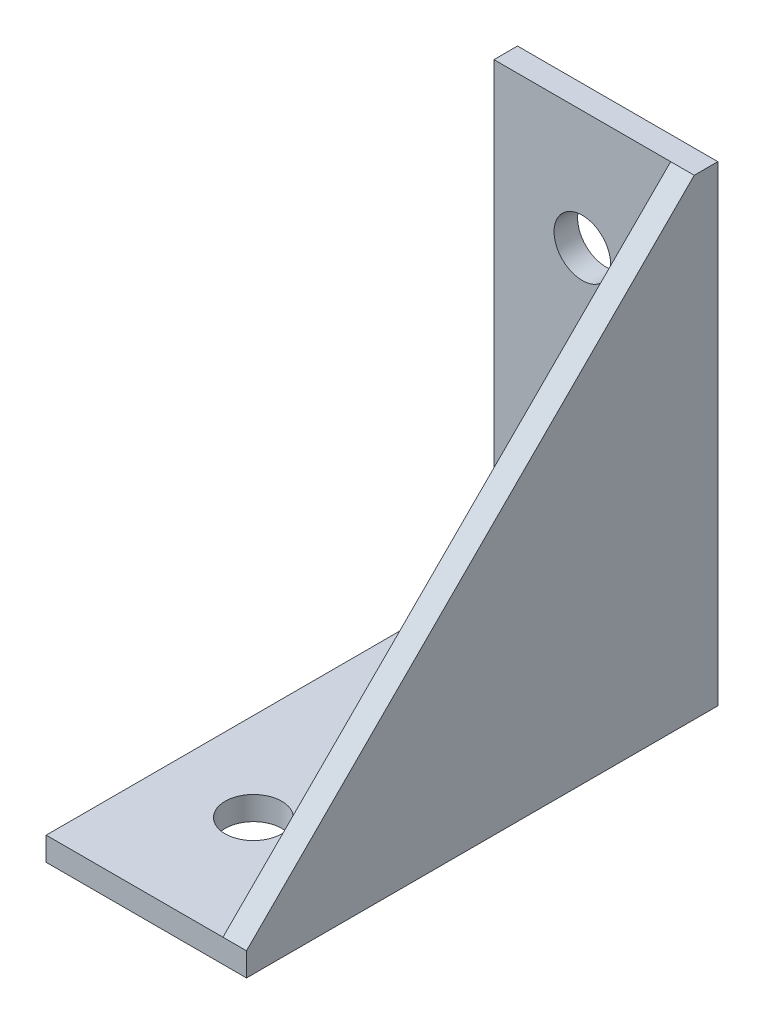
ISO-10303-21;
HEADER;
FILE_DESCRIPTION(('STEP AP214'),'2;1');
FILE_NAME('part.step','',(''),(''),'','','');
FILE_SCHEMA(('AUTOMOTIVE_DESIGN { 1 0 10303 214 1 1 1 1 }'));
ENDSEC;
DATA;
#1=APPLICATION_CONTEXT('core data for automotive mechanical design processes');
#2=APPLICATION_PROTOCOL_DEFINITION('international standard','automotive_design',2000,#1);
#3=PRODUCT_CONTEXT('',#1,'mechanical');
#4=PRODUCT('Part','Part','',(#3));
#5=PRODUCT_RELATED_PRODUCT_CATEGORY('part','',(#4));
#6=PRODUCT_DEFINITION_FORMATION('','',#4);
#7=PRODUCT_DEFINITION_CONTEXT('part definition',#1,'design');
#8=PRODUCT_DEFINITION('design','',#6,#7);
#9=PRODUCT_DEFINITION_SHAPE('','',#8);
#10=(LENGTH_UNIT() NAMED_UNIT(*) SI_UNIT(.MILLI.,.METRE.));
#11=(NAMED_UNIT(*) PLANE_ANGLE_UNIT() SI_UNIT($,.RADIAN.));
#12=(NAMED_UNIT(*) SI_UNIT($,.STERADIAN.) SOLID_ANGLE_UNIT());
#13=UNCERTAINTY_MEASURE_WITH_UNIT(LENGTH_MEASURE(1.E-05),#10,'distance_accuracy_value','');
#14=(GEOMETRIC_REPRESENTATION_CONTEXT(3) GLOBAL_UNCERTAINTY_ASSIGNED_CONTEXT((#13)) GLOBAL_UNIT_ASSIGNED_CONTEXT((#10,
#11,#12)) REPRESENTATION_CONTEXT('',''));
#15=CARTESIAN_POINT('',(0.,0.,0.));
#16=DIRECTION('',(0.,0.,1.));
#17=DIRECTION('',(1.,0.,0.));
#18=AXIS2_PLACEMENT_3D('',#15,#16,#17);
#19=CARTESIAN_POINT('',(-15.,-2.,38.));
#20=DIRECTION('',(0.,-1.,0.));
#21=DIRECTION('',(0.,0.,-1.));
#22=AXIS2_PLACEMENT_3D('',#19,#20,#21);
#23=PLANE('',#22);
#24=CARTESIAN_POINT('',(-7.5,-2.,27.9109691372457));
#25=DIRECTION('',(0.,1.,0.));
#26=DIRECTION('',(0.,0.,1.));
#27=AXIS2_PLACEMENT_3D('',#24,#25,#26);
#28=CIRCLE('',#27,2.4);
#29=CARTESIAN_POINT('',(-7.5,-2.,30.3109691372457));
#30=VERTEX_POINT('',#29);
#31=EDGE_CURVE('E232',#30,#30,#28,.T.);
#32=ORIENTED_EDGE('',*,*,#31,.T.);
#33=EDGE_LOOP('',(#32));
#34=FACE_BOUND('',#33,.T.);
#35=DIRECTION('',(0.,0.,-1.));
#36=VECTOR('',#35,1.);
#37=CARTESIAN_POINT('',(2.,-2.,38.));
#38=LINE('',#37,#36);
#39=CARTESIAN_POINT('',(2.,-2.,38.));
#40=VERTEX_POINT('',#39);
#41=CARTESIAN_POINT('',(2.,-2.,-2.));
#42=VERTEX_POINT('',#41);
#43=EDGE_CURVE('E168',#40,#42,#38,.T.);
#44=ORIENTED_EDGE('',*,*,#43,.F.);
#45=DIRECTION('',(1.,0.,0.));
#46=VECTOR('',#45,1.);
#47=CARTESIAN_POINT('',(-15.,-2.,38.));
#48=LINE('',#47,#46);
#49=CARTESIAN_POINT('',(-15.,-2.,38.));
#50=VERTEX_POINT('',#49);
#51=EDGE_CURVE('E184',#50,#40,#48,.T.);
#52=ORIENTED_EDGE('',*,*,#51,.F.);
#53=DIRECTION('',(0.,0.,-1.));
#54=VECTOR('',#53,1.);
#55=CARTESIAN_POINT('',(-15.,-2.,38.));
#56=LINE('',#55,#54);
#57=CARTESIAN_POINT('',(-15.,-2.,-2.));
#58=VERTEX_POINT('',#57);
#59=EDGE_CURVE('E155',#50,#58,#56,.T.);
#60=ORIENTED_EDGE('',*,*,#59,.T.);
#61=DIRECTION('',(1.,0.,0.));
#62=VECTOR('',#61,1.);
#63=CARTESIAN_POINT('',(-15.,-2.,-2.));
#64=LINE('',#63,#62);
#65=EDGE_CURVE('E181',#58,#42,#64,.T.);
#66=ORIENTED_EDGE('',*,*,#65,.T.);
#67=EDGE_LOOP('',(#44,#52,#60,#66));
#68=FACE_BOUND('',#67,.T.);
#69=CARTESIAN_POINT('',(-7.5,-2.,10.0890308627543));
#70=DIRECTION('',(0.,1.,0.));
#71=DIRECTION('',(0.,0.,1.));
#72=AXIS2_PLACEMENT_3D('',#69,#70,#71);
#73=CIRCLE('',#72,2.4);
#74=CARTESIAN_POINT('',(-7.5,-2.,12.4890308627543));
#75=VERTEX_POINT('',#74);
#76=EDGE_CURVE('E242',#75,#75,#73,.T.);
#77=ORIENTED_EDGE('',*,*,#76,.T.);
#78=EDGE_LOOP('',(#77));
#79=FACE_BOUND('',#78,.T.);
#80=ADVANCED_FACE('F42',(#34,#68,#79),#23,.T.);
#81=CARTESIAN_POINT('',(-15.,-2.,-2.));
#82=DIRECTION('',(0.,0.,-1.));
#83=DIRECTION('',(0.,1.,0.));
#84=AXIS2_PLACEMENT_3D('',#81,#82,#83);
#85=PLANE('',#84);
#86=DIRECTION('',(0.,1.,0.));
#87=VECTOR('',#86,1.);
#88=CARTESIAN_POINT('',(2.,-2.,-2.));
#89=LINE('',#88,#87);
#90=CARTESIAN_POINT('',(2.,38.,-2.));
#91=VERTEX_POINT('',#90);
#92=EDGE_CURVE('E147',#42,#91,#89,.T.);
#93=ORIENTED_EDGE('',*,*,#92,.F.);
#94=ORIENTED_EDGE('',*,*,#65,.F.);
#95=DIRECTION('',(0.,1.,0.));
#96=VECTOR('',#95,1.);
#97=CARTESIAN_POINT('',(-15.,-2.,-2.));
#98=LINE('',#97,#96);
#99=CARTESIAN_POINT('',(-15.,38.,-2.));
#100=VERTEX_POINT('',#99);
#101=EDGE_CURVE('E159',#58,#100,#98,.T.);
#102=ORIENTED_EDGE('',*,*,#101,.T.);
#103=DIRECTION('',(1.,0.,0.));
#104=VECTOR('',#103,1.);
#105=CARTESIAN_POINT('',(-15.,38.,-2.));
#106=LINE('',#105,#104);
#107=EDGE_CURVE('E178',#100,#91,#106,.T.);
#108=ORIENTED_EDGE('',*,*,#107,.T.);
#109=EDGE_LOOP('',(#93,#94,#102,#108));
#110=FACE_BOUND('',#109,.T.);
#111=CARTESIAN_POINT('',(-7.5,10.0890308627543,-2.));
#112=DIRECTION('',(0.,0.,1.));
#113=DIRECTION('',(1.,0.,0.));
#114=AXIS2_PLACEMENT_3D('',#111,#112,#113);
#115=CIRCLE('',#114,2.4);
#116=CARTESIAN_POINT('',(-5.1,10.0890308627543,-2.));
#117=VERTEX_POINT('',#116);
#118=EDGE_CURVE('E150',#117,#117,#115,.T.);
#119=ORIENTED_EDGE('',*,*,#118,.T.);
#120=EDGE_LOOP('',(#119));
#121=FACE_BOUND('',#120,.T.);
#122=CARTESIAN_POINT('',(-7.5,27.9109691372457,-2.));
#123=DIRECTION('',(0.,0.,1.));
#124=DIRECTION('',(1.,0.,0.));
#125=AXIS2_PLACEMENT_3D('',#122,#123,#124);
#126=CIRCLE('',#125,2.4);
#127=CARTESIAN_POINT('',(-5.1,27.9109691372457,-2.));
#128=VERTEX_POINT('',#127);
#129=EDGE_CURVE('E222',#128,#128,#126,.T.);
#130=ORIENTED_EDGE('',*,*,#129,.T.);
#131=EDGE_LOOP('',(#130));
#132=FACE_BOUND('',#131,.T.);
#133=ADVANCED_FACE('F213',(#110,#121,#132),#85,.T.);
#134=CARTESIAN_POINT('',(2.,38.,0.));
#135=DIRECTION('',(0.,-0.707106781186547,-0.707106781186547));
#136=DIRECTION('',(0.,0.707106781186548,-0.707106781186548));
#137=AXIS2_PLACEMENT_3D('',#134,#135,#136);
#138=PLANE('',#137);
#139=DIRECTION('',(0.,-0.707106781186548,0.707106781186548));
#140=VECTOR('',#139,1.);
#141=CARTESIAN_POINT('',(0.,38.,0.));
#142=LINE('',#141,#140);
#143=CARTESIAN_POINT('',(0.,38.,0.));
#144=VERTEX_POINT('',#143);
#145=CARTESIAN_POINT('',(0.,0.,38.));
#146=VERTEX_POINT('',#145);
#147=EDGE_CURVE('E177',#144,#146,#142,.T.);
#148=ORIENTED_EDGE('',*,*,#147,.T.);
#149=DIRECTION('',(-1.,0.,0.));
#150=VECTOR('',#149,1.);
#151=CARTESIAN_POINT('',(2.,0.,38.));
#152=LINE('',#151,#150);
#153=CARTESIAN_POINT('',(2.,0.,38.));
#154=VERTEX_POINT('',#153);
#155=EDGE_CURVE('E11',#154,#146,#152,.T.);
#156=ORIENTED_EDGE('',*,*,#155,.F.);
#157=DIRECTION('',(0.,-0.707106781186548,0.707106781186548));
#158=VECTOR('',#157,1.);
#159=CARTESIAN_POINT('',(2.,38.,0.));
#160=LINE('',#159,#158);
#161=CARTESIAN_POINT('',(2.,38.,0.));
#162=VERTEX_POINT('',#161);
#163=EDGE_CURVE('E62',#162,#154,#160,.T.);
#164=ORIENTED_EDGE('',*,*,#163,.F.);
#165=DIRECTION('',(-1.,0.,0.));
#166=VECTOR('',#165,1.);
#167=CARTESIAN_POINT('',(2.,38.,0.));
#168=LINE('',#167,#166);
#169=EDGE_CURVE('E51',#162,#144,#168,.T.);
#170=ORIENTED_EDGE('',*,*,#169,.T.);
#171=EDGE_LOOP('',(#148,#156,#164,#170));
#172=FACE_BOUND('',#171,.T.);
#173=ADVANCED_FACE('F44',(#172),#138,.F.);
#174=CARTESIAN_POINT('',(2.,0.,0.));
#175=DIRECTION('',(1.,0.,0.));
#176=DIRECTION('',(0.,0.,-1.));
#177=AXIS2_PLACEMENT_3D('',#174,#175,#176);
#178=PLANE('',#177);
#179=DIRECTION('',(0.,0.,1.));
#180=VECTOR('',#179,1.);
#181=CARTESIAN_POINT('',(2.,38.,0.));
#182=LINE('',#181,#180);
#183=EDGE_CURVE('E142',#91,#162,#182,.T.);
#184=ORIENTED_EDGE('',*,*,#183,.T.);
#185=ORIENTED_EDGE('',*,*,#163,.T.);
#186=DIRECTION('',(0.,-1.,0.));
#187=VECTOR('',#186,1.);
#188=CARTESIAN_POINT('',(2.,0.,38.));
#189=LINE('',#188,#187);
#190=EDGE_CURVE('E164',#154,#40,#189,.T.);
#191=ORIENTED_EDGE('',*,*,#190,.T.);
#192=ORIENTED_EDGE('',*,*,#43,.T.);
#193=ORIENTED_EDGE('',*,*,#92,.T.);
#194=EDGE_LOOP('',(#184,#185,#191,#192,#193));
#195=FACE_BOUND('',#194,.T.);
#196=ADVANCED_FACE('F212',(#195),#178,.T.);
#197=CARTESIAN_POINT('',(0.,0.,0.));
#198=DIRECTION('',(1.,0.,0.));
#199=DIRECTION('',(0.,0.,-1.));
#200=AXIS2_PLACEMENT_3D('',#197,#198,#199);
#201=PLANE('',#200);
#202=ORIENTED_EDGE('',*,*,#147,.F.);
#203=DIRECTION('',(0.,1.,0.));
#204=VECTOR('',#203,1.);
#205=CARTESIAN_POINT('',(0.,0.,0.));
#206=LINE('',#205,#204);
#207=CARTESIAN_POINT('',(0.,0.,0.));
#208=VERTEX_POINT('',#207);
#209=EDGE_CURVE('E79',#208,#144,#206,.T.);
#210=ORIENTED_EDGE('',*,*,#209,.F.);
#211=DIRECTION('',(0.,0.,-1.));
#212=VECTOR('',#211,1.);
#213=CARTESIAN_POINT('',(0.,0.,38.));
#214=LINE('',#213,#212);
#215=EDGE_CURVE('E73',#146,#208,#214,.T.);
#216=ORIENTED_EDGE('',*,*,#215,.F.);
#217=EDGE_LOOP('',(#202,#210,#216));
#218=FACE_BOUND('',#217,.T.);
#219=ADVANCED_FACE('F200',(#218),#201,.F.);
#220=CARTESIAN_POINT('',(-15.,38.,0.));
#221=DIRECTION('',(0.,0.,1.));
#222=DIRECTION('',(1.,0.,0.));
#223=AXIS2_PLACEMENT_3D('',#220,#221,#222);
#224=PLANE('',#223);
#225=CARTESIAN_POINT('',(-7.5,27.9109691372457,0.));
#226=DIRECTION('',(0.,0.,1.));
#227=DIRECTION('',(1.,0.,0.));
#228=AXIS2_PLACEMENT_3D('',#225,#226,#227);
#229=CIRCLE('',#228,2.39999999999999);
#230=CARTESIAN_POINT('',(-5.10000000000001,27.9109691372457,0.));
#231=VERTEX_POINT('',#230);
#232=EDGE_CURVE('E226',#231,#231,#229,.T.);
#233=ORIENTED_EDGE('',*,*,#232,.F.);
#234=EDGE_LOOP('',(#233));
#235=FACE_BOUND('',#234,.T.);
#236=CARTESIAN_POINT('',(-7.5,10.0890308627543,0.));
#237=DIRECTION('',(0.,0.,1.));
#238=DIRECTION('',(1.,0.,0.));
#239=AXIS2_PLACEMENT_3D('',#236,#237,#238);
#240=CIRCLE('',#239,2.39999999999999);
#241=CARTESIAN_POINT('',(-5.10000000000001,10.0890308627543,0.));
#242=VERTEX_POINT('',#241);
#243=EDGE_CURVE('E225',#242,#242,#240,.T.);
#244=ORIENTED_EDGE('',*,*,#243,.F.);
#245=EDGE_LOOP('',(#244));
#246=FACE_BOUND('',#245,.T.);
#247=ORIENTED_EDGE('',*,*,#209,.T.);
#248=DIRECTION('',(1.,0.,0.));
#249=VECTOR('',#248,1.);
#250=CARTESIAN_POINT('',(-15.,38.,0.));
#251=LINE('',#250,#249);
#252=CARTESIAN_POINT('',(-15.,38.,0.));
#253=VERTEX_POINT('',#252);
#254=EDGE_CURVE('E140',#253,#144,#251,.T.);
#255=ORIENTED_EDGE('',*,*,#254,.F.);
#256=DIRECTION('',(0.,-1.,0.));
#257=VECTOR('',#256,1.);
#258=CARTESIAN_POINT('',(-15.,38.,0.));
#259=LINE('',#258,#257);
#260=CARTESIAN_POINT('',(-15.,0.,0.));
#261=VERTEX_POINT('',#260);
#262=EDGE_CURVE('E131',#253,#261,#259,.T.);
#263=ORIENTED_EDGE('',*,*,#262,.T.);
#264=DIRECTION('',(1.,0.,0.));
#265=VECTOR('',#264,1.);
#266=CARTESIAN_POINT('',(-15.,0.,0.));
#267=LINE('',#266,#265);
#268=EDGE_CURVE('E115',#261,#208,#267,.T.);
#269=ORIENTED_EDGE('',*,*,#268,.T.);
#270=EDGE_LOOP('',(#247,#255,#263,#269));
#271=FACE_BOUND('',#270,.T.);
#272=ADVANCED_FACE('F138',(#235,#246,#271),#224,.T.);
#273=CARTESIAN_POINT('',(-15.,0.,0.));
#274=DIRECTION('',(0.,1.,0.));
#275=DIRECTION('',(0.,0.,1.));
#276=AXIS2_PLACEMENT_3D('',#273,#274,#275);
#277=PLANE('',#276);
#278=CARTESIAN_POINT('',(-7.5,0.,10.0890308627543));
#279=DIRECTION('',(0.,1.,0.));
#280=DIRECTION('',(0.,0.,1.));
#281=AXIS2_PLACEMENT_3D('',#278,#279,#280);
#282=CIRCLE('',#281,2.39999999999999);
#283=CARTESIAN_POINT('',(-7.5,0.,12.4890308627543));
#284=VERTEX_POINT('',#283);
#285=EDGE_CURVE('E246',#284,#284,#282,.T.);
#286=ORIENTED_EDGE('',*,*,#285,.F.);
#287=EDGE_LOOP('',(#286));
#288=FACE_BOUND('',#287,.T.);
#289=CARTESIAN_POINT('',(-7.5,0.,27.9109691372457));
#290=DIRECTION('',(0.,1.,0.));
#291=DIRECTION('',(0.,0.,1.));
#292=AXIS2_PLACEMENT_3D('',#289,#290,#291);
#293=CIRCLE('',#292,2.39999999999999);
#294=CARTESIAN_POINT('',(-7.5,0.,30.3109691372457));
#295=VERTEX_POINT('',#294);
#296=EDGE_CURVE('E238',#295,#295,#293,.T.);
#297=ORIENTED_EDGE('',*,*,#296,.F.);
#298=EDGE_LOOP('',(#297));
#299=FACE_BOUND('',#298,.T.);
#300=ORIENTED_EDGE('',*,*,#215,.T.);
#301=ORIENTED_EDGE('',*,*,#268,.F.);
#302=DIRECTION('',(0.,0.,1.));
#303=VECTOR('',#302,1.);
#304=CARTESIAN_POINT('',(-15.,0.,0.));
#305=LINE('',#304,#303);
#306=CARTESIAN_POINT('',(-15.,0.,38.));
#307=VERTEX_POINT('',#306);
#308=EDGE_CURVE('E119',#261,#307,#305,.T.);
#309=ORIENTED_EDGE('',*,*,#308,.T.);
#310=DIRECTION('',(1.,0.,0.));
#311=VECTOR('',#310,1.);
#312=CARTESIAN_POINT('',(-15.,0.,38.));
#313=LINE('',#312,#311);
#314=EDGE_CURVE('E123',#307,#146,#313,.T.);
#315=ORIENTED_EDGE('',*,*,#314,.T.);
#316=EDGE_LOOP('',(#300,#301,#309,#315));
#317=FACE_BOUND('',#316,.T.);
#318=ADVANCED_FACE('F117',(#288,#299,#317),#277,.T.);
#319=CARTESIAN_POINT('',(-15.,38.,0.));
#320=DIRECTION('',(0.,1.,0.));
#321=DIRECTION('',(0.,0.,1.));
#322=AXIS2_PLACEMENT_3D('',#319,#320,#321);
#323=PLANE('',#322);
#324=ORIENTED_EDGE('',*,*,#183,.F.);
#325=ORIENTED_EDGE('',*,*,#107,.F.);
#326=DIRECTION('',(0.,0.,1.));
#327=VECTOR('',#326,1.);
#328=CARTESIAN_POINT('',(-15.,38.,0.));
#329=LINE('',#328,#327);
#330=EDGE_CURVE('E124',#100,#253,#329,.T.);
#331=ORIENTED_EDGE('',*,*,#330,.T.);
#332=ORIENTED_EDGE('',*,*,#254,.T.);
#333=ORIENTED_EDGE('',*,*,#169,.F.);
#334=EDGE_LOOP('',(#324,#325,#331,#332,#333));
#335=FACE_BOUND('',#334,.T.);
#336=ADVANCED_FACE('F201',(#335),#323,.T.);
#337=CARTESIAN_POINT('',(-15.,0.,38.));
#338=DIRECTION('',(0.,0.,1.));
#339=DIRECTION('',(1.,0.,0.));
#340=AXIS2_PLACEMENT_3D('',#337,#338,#339);
#341=PLANE('',#340);
#342=ORIENTED_EDGE('',*,*,#190,.F.);
#343=ORIENTED_EDGE('',*,*,#155,.T.);
#344=ORIENTED_EDGE('',*,*,#314,.F.);
#345=DIRECTION('',(0.,-1.,0.));
#346=VECTOR('',#345,1.);
#347=CARTESIAN_POINT('',(-15.,0.,38.));
#348=LINE('',#347,#346);
#349=EDGE_CURVE('E135',#307,#50,#348,.T.);
#350=ORIENTED_EDGE('',*,*,#349,.T.);
#351=ORIENTED_EDGE('',*,*,#51,.T.);
#352=EDGE_LOOP('',(#342,#343,#344,#350,#351));
#353=FACE_BOUND('',#352,.T.);
#354=ADVANCED_FACE('F210',(#353),#341,.T.);
#355=CARTESIAN_POINT('',(-15.,0.,0.));
#356=DIRECTION('',(-1.,0.,0.));
#357=DIRECTION('',(0.,0.,1.));
#358=AXIS2_PLACEMENT_3D('',#355,#356,#357);
#359=PLANE('',#358);
#360=ORIENTED_EDGE('',*,*,#262,.F.);
#361=ORIENTED_EDGE('',*,*,#330,.F.);
#362=ORIENTED_EDGE('',*,*,#101,.F.);
#363=ORIENTED_EDGE('',*,*,#59,.F.);
#364=ORIENTED_EDGE('',*,*,#349,.F.);
#365=ORIENTED_EDGE('',*,*,#308,.F.);
#366=EDGE_LOOP('',(#360,#361,#362,#363,#364,#365));
#367=FACE_BOUND('',#366,.T.);
#368=ADVANCED_FACE('F129',(#367),#359,.T.);
#369=CARTESIAN_POINT('',(-7.5,10.0890308627543,0.));
#370=DIRECTION('',(0.,0.,1.));
#371=DIRECTION('',(1.,0.,0.));
#372=AXIS2_PLACEMENT_3D('',#369,#370,#371);
#373=CYLINDRICAL_SURFACE('',#372,2.39999999999999);
#374=ORIENTED_EDGE('',*,*,#118,.F.);
#375=EDGE_LOOP('',(#374));
#376=FACE_BOUND('',#375,.T.);
#377=ORIENTED_EDGE('',*,*,#243,.T.);
#378=EDGE_LOOP('',(#377));
#379=FACE_BOUND('',#378,.T.);
#380=ADVANCED_FACE('F269',(#376,#379),#373,.F.);
#381=CARTESIAN_POINT('',(-7.5,27.9109691372457,0.));
#382=DIRECTION('',(0.,0.,1.));
#383=DIRECTION('',(1.,0.,0.));
#384=AXIS2_PLACEMENT_3D('',#381,#382,#383);
#385=CYLINDRICAL_SURFACE('',#384,2.39999999999999);
#386=ORIENTED_EDGE('',*,*,#129,.F.);
#387=EDGE_LOOP('',(#386));
#388=FACE_BOUND('',#387,.T.);
#389=ORIENTED_EDGE('',*,*,#232,.T.);
#390=EDGE_LOOP('',(#389));
#391=FACE_BOUND('',#390,.T.);
#392=ADVANCED_FACE('F260',(#388,#391),#385,.F.);
#393=CARTESIAN_POINT('',(-7.5,0.,27.9109691372457));
#394=DIRECTION('',(0.,1.,0.));
#395=DIRECTION('',(0.,0.,1.));
#396=AXIS2_PLACEMENT_3D('',#393,#394,#395);
#397=CYLINDRICAL_SURFACE('',#396,2.39999999999999);
#398=ORIENTED_EDGE('',*,*,#31,.F.);
#399=EDGE_LOOP('',(#398));
#400=FACE_BOUND('',#399,.T.);
#401=ORIENTED_EDGE('',*,*,#296,.T.);
#402=EDGE_LOOP('',(#401));
#403=FACE_BOUND('',#402,.T.);
#404=ADVANCED_FACE('F258',(#400,#403),#397,.F.);
#405=CARTESIAN_POINT('',(-7.5,0.,10.0890308627543));
#406=DIRECTION('',(0.,1.,0.));
#407=DIRECTION('',(0.,0.,1.));
#408=AXIS2_PLACEMENT_3D('',#405,#406,#407);
#409=CYLINDRICAL_SURFACE('',#408,2.39999999999999);
#410=ORIENTED_EDGE('',*,*,#76,.F.);
#411=EDGE_LOOP('',(#410));
#412=FACE_BOUND('',#411,.T.);
#413=ORIENTED_EDGE('',*,*,#285,.T.);
#414=EDGE_LOOP('',(#413));
#415=FACE_BOUND('',#414,.T.);
#416=ADVANCED_FACE('F251',(#412,#415),#409,.F.);
#417=CLOSED_SHELL('',(#80,#133,#173,#196,#219,#272,#318,#336,#354,#368,#380,#392,#404,#416));
#418=MANIFOLD_SOLID_BREP('B2',#417);
#419=ADVANCED_BREP_SHAPE_REPRESENTATION('',(#18,#418),#14);
#420=SHAPE_DEFINITION_REPRESENTATION(#9,#419);
ENDSEC;
END-ISO-10303-21;
